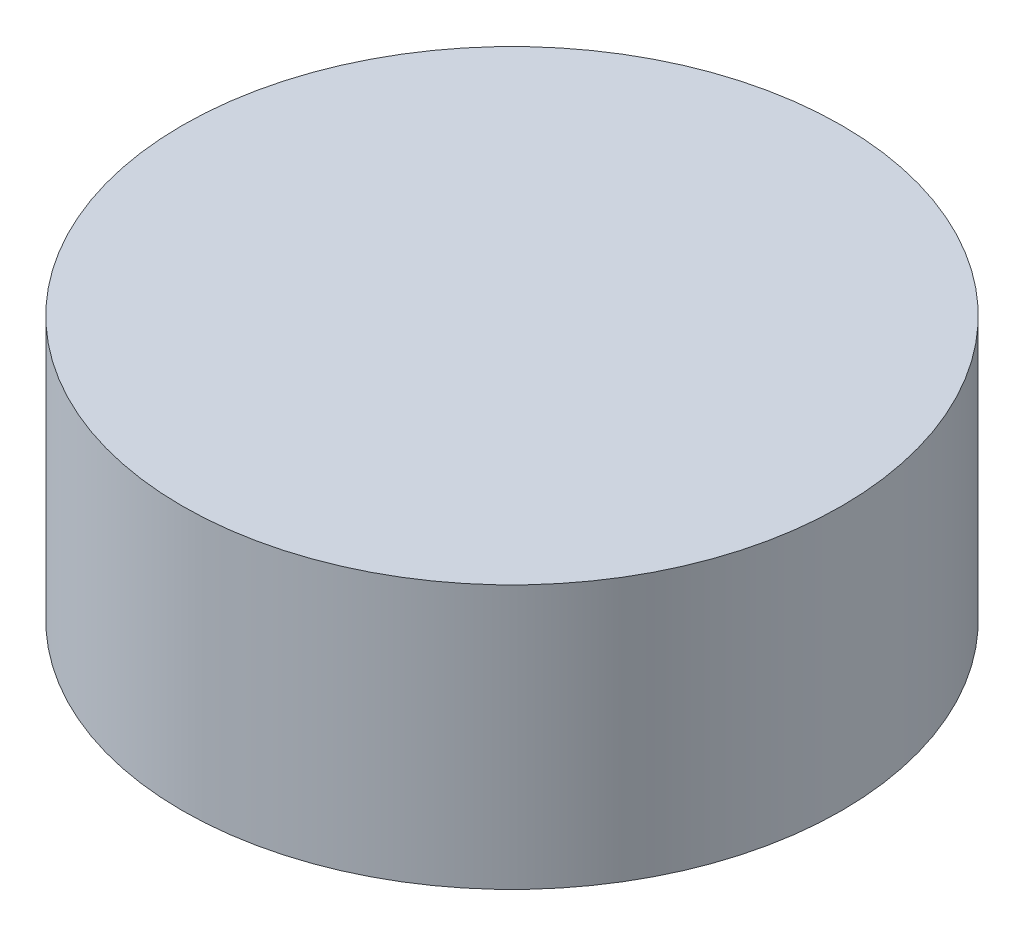
ISO-10303-21;
HEADER;
FILE_DESCRIPTION(('STEP AP214'),'2;1');
FILE_NAME('part.step','',(''),(''),'','','');
FILE_SCHEMA(('AUTOMOTIVE_DESIGN { 1 0 10303 214 1 1 1 1 }'));
ENDSEC;
DATA;
#1=APPLICATION_CONTEXT('core data for automotive mechanical design processes');
#2=APPLICATION_PROTOCOL_DEFINITION('international standard','automotive_design',2000,#1);
#3=PRODUCT_CONTEXT('',#1,'mechanical');
#4=PRODUCT('Part','Part','',(#3));
#5=PRODUCT_RELATED_PRODUCT_CATEGORY('part','',(#4));
#6=PRODUCT_DEFINITION_FORMATION('','',#4);
#7=PRODUCT_DEFINITION_CONTEXT('part definition',#1,'design');
#8=PRODUCT_DEFINITION('design','',#6,#7);
#9=PRODUCT_DEFINITION_SHAPE('','',#8);
#10=(LENGTH_UNIT() NAMED_UNIT(*) SI_UNIT(.MILLI.,.METRE.));
#11=(NAMED_UNIT(*) PLANE_ANGLE_UNIT() SI_UNIT($,.RADIAN.));
#12=(NAMED_UNIT(*) SI_UNIT($,.STERADIAN.) SOLID_ANGLE_UNIT());
#13=UNCERTAINTY_MEASURE_WITH_UNIT(LENGTH_MEASURE(1.E-05),#10,'distance_accuracy_value','');
#14=(GEOMETRIC_REPRESENTATION_CONTEXT(3) GLOBAL_UNCERTAINTY_ASSIGNED_CONTEXT((#13)) GLOBAL_UNIT_ASSIGNED_CONTEXT((#10,
#11,#12)) REPRESENTATION_CONTEXT('',''));
#15=CARTESIAN_POINT('',(0.,0.,0.));
#16=DIRECTION('',(0.,0.,1.));
#17=DIRECTION('',(1.,0.,0.));
#18=AXIS2_PLACEMENT_3D('',#15,#16,#17);
#19=CARTESIAN_POINT('',(0.,2.,0.));
#20=DIRECTION('',(0.,-1.,0.));
#21=DIRECTION('',(0.,0.,-1.));
#22=AXIS2_PLACEMENT_3D('',#19,#20,#21);
#23=CYLINDRICAL_SURFACE('',#22,2.5);
#24=CARTESIAN_POINT('',(0.,2.,0.));
#25=DIRECTION('',(0.,1.,0.));
#26=DIRECTION('',(0.,0.,1.));
#27=AXIS2_PLACEMENT_3D('',#24,#25,#26);
#28=CIRCLE('',#27,2.5);
#29=CARTESIAN_POINT('',(0.,2.,2.5));
#30=VERTEX_POINT('',#29);
#31=EDGE_CURVE('E10',#30,#30,#28,.T.);
#32=ORIENTED_EDGE('',*,*,#31,.F.);
#33=EDGE_LOOP('',(#32));
#34=FACE_BOUND('',#33,.T.);
#35=CARTESIAN_POINT('',(0.,0.,0.));
#36=DIRECTION('',(0.,1.,0.));
#37=DIRECTION('',(0.,0.,1.));
#38=AXIS2_PLACEMENT_3D('',#35,#36,#37);
#39=CIRCLE('',#38,2.5);
#40=CARTESIAN_POINT('',(0.,0.,2.5));
#41=VERTEX_POINT('',#40);
#42=EDGE_CURVE('E40',#41,#41,#39,.T.);
#43=ORIENTED_EDGE('',*,*,#42,.T.);
#44=EDGE_LOOP('',(#43));
#45=FACE_BOUND('',#44,.T.);
#46=ADVANCED_FACE('F37',(#34,#45),#23,.T.);
#47=CARTESIAN_POINT('',(0.,2.,0.));
#48=DIRECTION('',(0.,1.,0.));
#49=DIRECTION('',(0.,0.,1.));
#50=AXIS2_PLACEMENT_3D('',#47,#48,#49);
#51=PLANE('',#50);
#52=ORIENTED_EDGE('',*,*,#31,.T.);
#53=EDGE_LOOP('',(#52));
#54=FACE_BOUND('',#53,.T.);
#55=ADVANCED_FACE('F54',(#54),#51,.T.);
#56=CARTESIAN_POINT('',(0.,0.,0.));
#57=DIRECTION('',(0.,1.,0.));
#58=DIRECTION('',(0.,0.,1.));
#59=AXIS2_PLACEMENT_3D('',#56,#57,#58);
#60=PLANE('',#59);
#61=ORIENTED_EDGE('',*,*,#42,.F.);
#62=EDGE_LOOP('',(#61));
#63=FACE_BOUND('',#62,.T.);
#64=ADVANCED_FACE('F52',(#63),#60,.F.);
#65=CLOSED_SHELL('',(#46,#55,#64));
#66=MANIFOLD_SOLID_BREP('B2',#65);
#67=ADVANCED_BREP_SHAPE_REPRESENTATION('',(#18,#66),#14);
#68=SHAPE_DEFINITION_REPRESENTATION(#9,#67);
ENDSEC;
END-ISO-10303-21;
